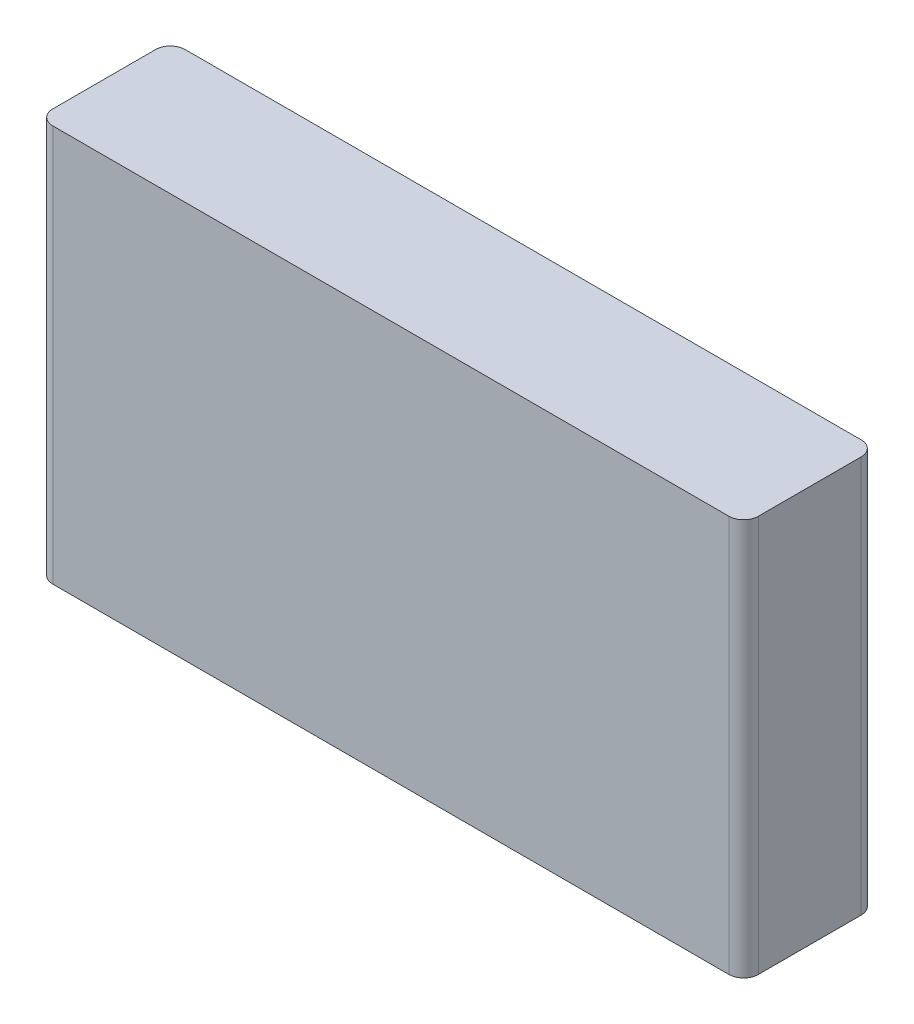
ISO-10303-21;
HEADER;
FILE_DESCRIPTION(('STEP AP214'),'2;1');
FILE_NAME('part.step','',(''),(''),'','','');
FILE_SCHEMA(('AUTOMOTIVE_DESIGN { 1 0 10303 214 1 1 1 1 }'));
ENDSEC;
DATA;
#1=APPLICATION_CONTEXT('core data for automotive mechanical design processes');
#2=APPLICATION_PROTOCOL_DEFINITION('international standard','automotive_design',2000,#1);
#3=PRODUCT_CONTEXT('',#1,'mechanical');
#4=PRODUCT('Part','Part','',(#3));
#5=PRODUCT_RELATED_PRODUCT_CATEGORY('part','',(#4));
#6=PRODUCT_DEFINITION_FORMATION('','',#4);
#7=PRODUCT_DEFINITION_CONTEXT('part definition',#1,'design');
#8=PRODUCT_DEFINITION('design','',#6,#7);
#9=PRODUCT_DEFINITION_SHAPE('','',#8);
#10=(LENGTH_UNIT() NAMED_UNIT(*) SI_UNIT(.MILLI.,.METRE.));
#11=(NAMED_UNIT(*) PLANE_ANGLE_UNIT() SI_UNIT($,.RADIAN.));
#12=(NAMED_UNIT(*) SI_UNIT($,.STERADIAN.) SOLID_ANGLE_UNIT());
#13=UNCERTAINTY_MEASURE_WITH_UNIT(LENGTH_MEASURE(1.E-05),#10,'distance_accuracy_value','');
#14=(GEOMETRIC_REPRESENTATION_CONTEXT(3) GLOBAL_UNCERTAINTY_ASSIGNED_CONTEXT((#13)) GLOBAL_UNIT_ASSIGNED_CONTEXT((#10,
#11,#12)) REPRESENTATION_CONTEXT('',''));
#15=CARTESIAN_POINT('',(0.,0.,0.));
#16=DIRECTION('',(0.,0.,1.));
#17=DIRECTION('',(1.,0.,0.));
#18=AXIS2_PLACEMENT_3D('',#15,#16,#17);
#19=CARTESIAN_POINT('',(24.,13.5,9.));
#20=DIRECTION('',(-1.,0.,0.));
#21=DIRECTION('',(0.,0.,1.));
#22=AXIS2_PLACEMENT_3D('',#19,#20,#21);
#23=PLANE('',#22);
#24=DIRECTION('',(0.,0.,-1.));
#25=VECTOR('',#24,1.);
#26=CARTESIAN_POINT('',(24.,-13.5,9.));
#27=LINE('',#26,#25);
#28=CARTESIAN_POINT('',(24.,-13.5,8.));
#29=VERTEX_POINT('',#28);
#30=CARTESIAN_POINT('',(24.,-13.5,0.999999999999999));
#31=VERTEX_POINT('',#30);
#32=EDGE_CURVE('E121',#29,#31,#27,.T.);
#33=ORIENTED_EDGE('',*,*,#32,.T.);
#34=DIRECTION('',(0.,1.,0.));
#35=VECTOR('',#34,1.);
#36=CARTESIAN_POINT('',(24.,13.5,0.999999999999999));
#37=LINE('',#36,#35);
#38=CARTESIAN_POINT('',(24.,13.5,0.999999999999999));
#39=VERTEX_POINT('',#38);
#40=EDGE_CURVE('E11',#31,#39,#37,.T.);
#41=ORIENTED_EDGE('',*,*,#40,.T.);
#42=DIRECTION('',(0.,0.,-1.));
#43=VECTOR('',#42,1.);
#44=CARTESIAN_POINT('',(24.,13.5,9.));
#45=LINE('',#44,#43);
#46=CARTESIAN_POINT('',(24.,13.5,8.));
#47=VERTEX_POINT('',#46);
#48=EDGE_CURVE('E126',#47,#39,#45,.T.);
#49=ORIENTED_EDGE('',*,*,#48,.F.);
#50=DIRECTION('',(0.,1.,0.));
#51=VECTOR('',#50,1.);
#52=CARTESIAN_POINT('',(24.,-13.5,8.));
#53=LINE('',#52,#51);
#54=EDGE_CURVE('E41',#47,#29,#53,.F.);
#55=ORIENTED_EDGE('',*,*,#54,.T.);
#56=EDGE_LOOP('',(#33,#41,#49,#55));
#57=FACE_BOUND('',#56,.T.);
#58=ADVANCED_FACE('F33',(#57),#23,.F.);
#59=CARTESIAN_POINT('',(-24.,13.5,9.));
#60=DIRECTION('',(0.,-1.,0.));
#61=DIRECTION('',(0.,0.,-1.));
#62=AXIS2_PLACEMENT_3D('',#59,#60,#61);
#63=PLANE('',#62);
#64=DIRECTION('',(-1.,0.,0.));
#65=VECTOR('',#64,1.);
#66=CARTESIAN_POINT('',(-24.,13.5,0.));
#67=LINE('',#66,#65);
#68=CARTESIAN_POINT('',(23.,13.5,0.));
#69=VERTEX_POINT('',#68);
#70=CARTESIAN_POINT('',(-23.,13.5,0.));
#71=VERTEX_POINT('',#70);
#72=EDGE_CURVE('E168',#69,#71,#67,.T.);
#73=ORIENTED_EDGE('',*,*,#72,.T.);
#74=CARTESIAN_POINT('',(-23.,13.5,0.999999999999999));
#75=DIRECTION('',(0.,-1.,0.));
#76=DIRECTION('',(0.,0.,-1.));
#77=AXIS2_PLACEMENT_3D('',#74,#75,#76);
#78=CIRCLE('',#77,1.);
#79=CARTESIAN_POINT('',(-24.,13.5,0.999999999999999));
#80=VERTEX_POINT('',#79);
#81=EDGE_CURVE('E143',#71,#80,#78,.F.);
#82=ORIENTED_EDGE('',*,*,#81,.T.);
#83=DIRECTION('',(0.,0.,-1.));
#84=VECTOR('',#83,1.);
#85=CARTESIAN_POINT('',(-24.,13.5,9.));
#86=LINE('',#85,#84);
#87=CARTESIAN_POINT('',(-24.,13.5,8.));
#88=VERTEX_POINT('',#87);
#89=EDGE_CURVE('E120',#88,#80,#86,.T.);
#90=ORIENTED_EDGE('',*,*,#89,.F.);
#91=CARTESIAN_POINT('',(-23.,13.5,8.));
#92=DIRECTION('',(0.,-1.,0.));
#93=DIRECTION('',(0.,0.,-1.));
#94=AXIS2_PLACEMENT_3D('',#91,#92,#93);
#95=CIRCLE('',#94,1.);
#96=CARTESIAN_POINT('',(-23.,13.5,9.));
#97=VERTEX_POINT('',#96);
#98=EDGE_CURVE('E125',#88,#97,#95,.F.);
#99=ORIENTED_EDGE('',*,*,#98,.T.);
#100=DIRECTION('',(-1.,0.,0.));
#101=VECTOR('',#100,1.);
#102=CARTESIAN_POINT('',(-24.,13.5,9.));
#103=LINE('',#102,#101);
#104=CARTESIAN_POINT('',(23.,13.5,9.));
#105=VERTEX_POINT('',#104);
#106=EDGE_CURVE('E162',#105,#97,#103,.T.);
#107=ORIENTED_EDGE('',*,*,#106,.F.);
#108=CARTESIAN_POINT('',(23.,13.5,8.));
#109=DIRECTION('',(0.,-1.,0.));
#110=DIRECTION('',(0.,0.,-1.));
#111=AXIS2_PLACEMENT_3D('',#108,#109,#110);
#112=CIRCLE('',#111,1.);
#113=EDGE_CURVE('E55',#105,#47,#112,.F.);
#114=ORIENTED_EDGE('',*,*,#113,.T.);
#115=ORIENTED_EDGE('',*,*,#48,.T.);
#116=CARTESIAN_POINT('',(23.,13.5,0.999999999999999));
#117=DIRECTION('',(0.,-1.,0.));
#118=DIRECTION('',(0.,0.,-1.));
#119=AXIS2_PLACEMENT_3D('',#116,#117,#118);
#120=CIRCLE('',#119,1.);
#121=EDGE_CURVE('E48',#39,#69,#120,.F.);
#122=ORIENTED_EDGE('',*,*,#121,.T.);
#123=EDGE_LOOP('',(#73,#82,#90,#99,#107,#114,#115,#122));
#124=FACE_BOUND('',#123,.T.);
#125=ADVANCED_FACE('F164',(#124),#63,.F.);
#126=CARTESIAN_POINT('',(-24.,13.5,9.));
#127=DIRECTION('',(1.,0.,0.));
#128=DIRECTION('',(0.,1.,0.));
#129=AXIS2_PLACEMENT_3D('',#126,#127,#128);
#130=PLANE('',#129);
#131=ORIENTED_EDGE('',*,*,#89,.T.);
#132=DIRECTION('',(0.,-1.,0.));
#133=VECTOR('',#132,1.);
#134=CARTESIAN_POINT('',(-24.,13.5,0.999999999999999));
#135=LINE('',#134,#133);
#136=CARTESIAN_POINT('',(-24.,-13.5,0.999999999999999));
#137=VERTEX_POINT('',#136);
#138=EDGE_CURVE('E119',#80,#137,#135,.T.);
#139=ORIENTED_EDGE('',*,*,#138,.T.);
#140=DIRECTION('',(0.,0.,-1.));
#141=VECTOR('',#140,1.);
#142=CARTESIAN_POINT('',(-24.,-13.5,9.));
#143=LINE('',#142,#141);
#144=CARTESIAN_POINT('',(-24.,-13.5,8.));
#145=VERTEX_POINT('',#144);
#146=EDGE_CURVE('E102',#145,#137,#143,.T.);
#147=ORIENTED_EDGE('',*,*,#146,.F.);
#148=DIRECTION('',(0.,-1.,0.));
#149=VECTOR('',#148,1.);
#150=CARTESIAN_POINT('',(-24.,13.5,8.));
#151=LINE('',#150,#149);
#152=EDGE_CURVE('E116',#145,#88,#151,.F.);
#153=ORIENTED_EDGE('',*,*,#152,.T.);
#154=EDGE_LOOP('',(#131,#139,#147,#153));
#155=FACE_BOUND('',#154,.T.);
#156=ADVANCED_FACE('F115',(#155),#130,.F.);
#157=CARTESIAN_POINT('',(-24.,-13.5,9.));
#158=DIRECTION('',(0.,1.,0.));
#159=DIRECTION('',(0.,0.,1.));
#160=AXIS2_PLACEMENT_3D('',#157,#158,#159);
#161=PLANE('',#160);
#162=ORIENTED_EDGE('',*,*,#146,.T.);
#163=CARTESIAN_POINT('',(-23.,-13.5,0.999999999999999));
#164=DIRECTION('',(0.,1.,0.));
#165=DIRECTION('',(0.,0.,1.));
#166=AXIS2_PLACEMENT_3D('',#163,#164,#165);
#167=CIRCLE('',#166,1.);
#168=CARTESIAN_POINT('',(-23.,-13.5,0.));
#169=VERTEX_POINT('',#168);
#170=EDGE_CURVE('E109',#137,#169,#167,.F.);
#171=ORIENTED_EDGE('',*,*,#170,.T.);
#172=DIRECTION('',(1.,0.,0.));
#173=VECTOR('',#172,1.);
#174=CARTESIAN_POINT('',(-24.,-13.5,0.));
#175=LINE('',#174,#173);
#176=CARTESIAN_POINT('',(23.,-13.5,0.));
#177=VERTEX_POINT('',#176);
#178=EDGE_CURVE('E165',#169,#177,#175,.T.);
#179=ORIENTED_EDGE('',*,*,#178,.T.);
#180=CARTESIAN_POINT('',(23.,-13.5,0.999999999999999));
#181=DIRECTION('',(0.,1.,0.));
#182=DIRECTION('',(0.,0.,1.));
#183=AXIS2_PLACEMENT_3D('',#180,#181,#182);
#184=CIRCLE('',#183,1.);
#185=EDGE_CURVE('E110',#177,#31,#184,.F.);
#186=ORIENTED_EDGE('',*,*,#185,.T.);
#187=ORIENTED_EDGE('',*,*,#32,.F.);
#188=CARTESIAN_POINT('',(23.,-13.5,8.));
#189=DIRECTION('',(0.,1.,0.));
#190=DIRECTION('',(0.,0.,1.));
#191=AXIS2_PLACEMENT_3D('',#188,#189,#190);
#192=CIRCLE('',#191,1.);
#193=CARTESIAN_POINT('',(23.,-13.5,9.));
#194=VERTEX_POINT('',#193);
#195=EDGE_CURVE('E128',#29,#194,#192,.F.);
#196=ORIENTED_EDGE('',*,*,#195,.T.);
#197=DIRECTION('',(1.,0.,0.));
#198=VECTOR('',#197,1.);
#199=CARTESIAN_POINT('',(-24.,-13.5,9.));
#200=LINE('',#199,#198);
#201=CARTESIAN_POINT('',(-23.,-13.5,9.));
#202=VERTEX_POINT('',#201);
#203=EDGE_CURVE('E104',#202,#194,#200,.T.);
#204=ORIENTED_EDGE('',*,*,#203,.F.);
#205=CARTESIAN_POINT('',(-23.,-13.5,8.));
#206=DIRECTION('',(0.,1.,0.));
#207=DIRECTION('',(0.,0.,1.));
#208=AXIS2_PLACEMENT_3D('',#205,#206,#207);
#209=CIRCLE('',#208,1.);
#210=EDGE_CURVE('E99',#202,#145,#209,.F.);
#211=ORIENTED_EDGE('',*,*,#210,.T.);
#212=EDGE_LOOP('',(#162,#171,#179,#186,#187,#196,#204,#211));
#213=FACE_BOUND('',#212,.T.);
#214=ADVANCED_FACE('F101',(#213),#161,.F.);
#215=CARTESIAN_POINT('',(24.,-13.5,9.));
#216=DIRECTION('',(0.,0.,1.));
#217=DIRECTION('',(1.,0.,0.));
#218=AXIS2_PLACEMENT_3D('',#215,#216,#217);
#219=PLANE('',#218);
#220=ORIENTED_EDGE('',*,*,#106,.T.);
#221=DIRECTION('',(0.,-1.,0.));
#222=VECTOR('',#221,1.);
#223=CARTESIAN_POINT('',(-23.,-13.5,9.));
#224=LINE('',#223,#222);
#225=EDGE_CURVE('E148',#97,#202,#224,.T.);
#226=ORIENTED_EDGE('',*,*,#225,.T.);
#227=ORIENTED_EDGE('',*,*,#203,.T.);
#228=DIRECTION('',(0.,1.,0.));
#229=VECTOR('',#228,1.);
#230=CARTESIAN_POINT('',(23.,13.5,9.));
#231=LINE('',#230,#229);
#232=EDGE_CURVE('E145',#194,#105,#231,.T.);
#233=ORIENTED_EDGE('',*,*,#232,.T.);
#234=EDGE_LOOP('',(#220,#226,#227,#233));
#235=FACE_BOUND('',#234,.T.);
#236=ADVANCED_FACE('F161',(#235),#219,.T.);
#237=CARTESIAN_POINT('',(24.,-13.5,0.));
#238=DIRECTION('',(0.,0.,1.));
#239=DIRECTION('',(1.,0.,0.));
#240=AXIS2_PLACEMENT_3D('',#237,#238,#239);
#241=PLANE('',#240);
#242=ORIENTED_EDGE('',*,*,#178,.F.);
#243=DIRECTION('',(0.,-1.,0.));
#244=VECTOR('',#243,1.);
#245=CARTESIAN_POINT('',(-23.,-13.5,0.));
#246=LINE('',#245,#244);
#247=EDGE_CURVE('E138',#169,#71,#246,.F.);
#248=ORIENTED_EDGE('',*,*,#247,.T.);
#249=ORIENTED_EDGE('',*,*,#72,.F.);
#250=DIRECTION('',(0.,1.,0.));
#251=VECTOR('',#250,1.);
#252=CARTESIAN_POINT('',(23.,-13.5,0.));
#253=LINE('',#252,#251);
#254=EDGE_CURVE('E136',#69,#177,#253,.F.);
#255=ORIENTED_EDGE('',*,*,#254,.T.);
#256=EDGE_LOOP('',(#242,#248,#249,#255));
#257=FACE_BOUND('',#256,.T.);
#258=ADVANCED_FACE('F177',(#257),#241,.F.);
#259=CARTESIAN_POINT('',(-23.,13.5,0.999999999999999));
#260=DIRECTION('',(0.,-1.,0.));
#261=DIRECTION('',(1.,0.,0.));
#262=AXIS2_PLACEMENT_3D('',#259,#260,#261);
#263=CYLINDRICAL_SURFACE('',#262,1.);
#264=ORIENTED_EDGE('',*,*,#81,.F.);
#265=ORIENTED_EDGE('',*,*,#247,.F.);
#266=ORIENTED_EDGE('',*,*,#170,.F.);
#267=ORIENTED_EDGE('',*,*,#138,.F.);
#268=EDGE_LOOP('',(#264,#265,#266,#267));
#269=FACE_BOUND('',#268,.T.);
#270=ADVANCED_FACE('F173',(#269),#263,.T.);
#271=CARTESIAN_POINT('',(-23.,-13.5,8.));
#272=DIRECTION('',(0.,1.,0.));
#273=DIRECTION('',(-1.,0.,0.));
#274=AXIS2_PLACEMENT_3D('',#271,#272,#273);
#275=CYLINDRICAL_SURFACE('',#274,1.);
#276=ORIENTED_EDGE('',*,*,#98,.F.);
#277=ORIENTED_EDGE('',*,*,#152,.F.);
#278=ORIENTED_EDGE('',*,*,#210,.F.);
#279=ORIENTED_EDGE('',*,*,#225,.F.);
#280=EDGE_LOOP('',(#276,#277,#278,#279));
#281=FACE_BOUND('',#280,.T.);
#282=ADVANCED_FACE('F124',(#281),#275,.T.);
#283=CARTESIAN_POINT('',(23.,13.5,0.999999999999999));
#284=DIRECTION('',(0.,1.,0.));
#285=DIRECTION('',(0.,0.,1.));
#286=AXIS2_PLACEMENT_3D('',#283,#284,#285);
#287=CYLINDRICAL_SURFACE('',#286,1.);
#288=ORIENTED_EDGE('',*,*,#185,.F.);
#289=ORIENTED_EDGE('',*,*,#254,.F.);
#290=ORIENTED_EDGE('',*,*,#121,.F.);
#291=ORIENTED_EDGE('',*,*,#40,.F.);
#292=EDGE_LOOP('',(#288,#289,#290,#291));
#293=FACE_BOUND('',#292,.T.);
#294=ADVANCED_FACE('F179',(#293),#287,.T.);
#295=CARTESIAN_POINT('',(23.,-13.5,8.));
#296=DIRECTION('',(0.,-1.,0.));
#297=DIRECTION('',(0.,0.,-1.));
#298=AXIS2_PLACEMENT_3D('',#295,#296,#297);
#299=CYLINDRICAL_SURFACE('',#298,1.);
#300=ORIENTED_EDGE('',*,*,#195,.F.);
#301=ORIENTED_EDGE('',*,*,#54,.F.);
#302=ORIENTED_EDGE('',*,*,#113,.F.);
#303=ORIENTED_EDGE('',*,*,#232,.F.);
#304=EDGE_LOOP('',(#300,#301,#302,#303));
#305=FACE_BOUND('',#304,.T.);
#306=ADVANCED_FACE('F35',(#305),#299,.T.);
#307=CLOSED_SHELL('',(#58,#125,#156,#214,#236,#258,#270,#282,#294,#306));
#308=MANIFOLD_SOLID_BREP('B2',#307);
#309=ADVANCED_BREP_SHAPE_REPRESENTATION('',(#18,#308),#14);
#310=SHAPE_DEFINITION_REPRESENTATION(#9,#309);
ENDSEC;
END-ISO-10303-21;
